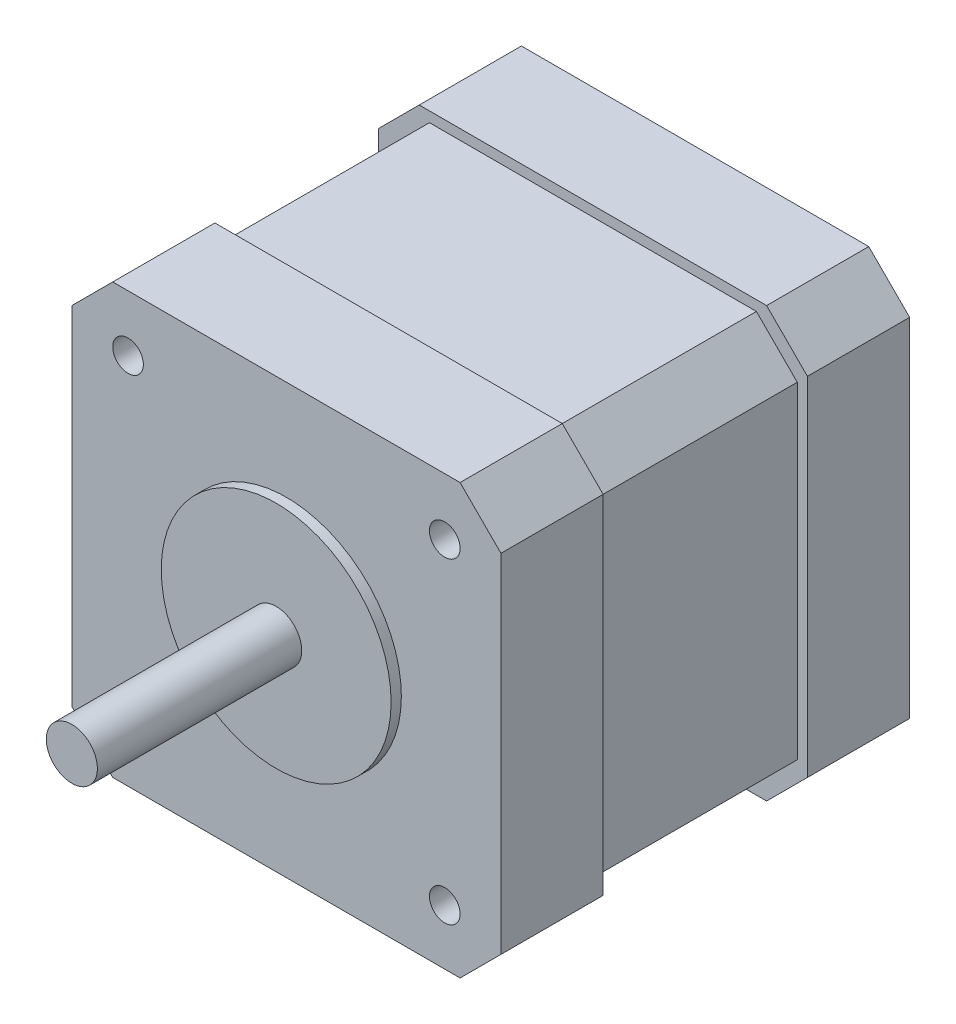
ISO-10303-21;
HEADER;
FILE_DESCRIPTION(('STEP AP214'),'2;1');
FILE_NAME('part.step','',(''),(''),'','','');
FILE_SCHEMA(('AUTOMOTIVE_DESIGN { 1 0 10303 214 1 1 1 1 }'));
ENDSEC;
DATA;
#1=APPLICATION_CONTEXT('core data for automotive mechanical design processes');
#2=APPLICATION_PROTOCOL_DEFINITION('international standard','automotive_design',2000,#1);
#3=PRODUCT_CONTEXT('',#1,'mechanical');
#4=PRODUCT('Part','Part','',(#3));
#5=PRODUCT_RELATED_PRODUCT_CATEGORY('part','',(#4));
#6=PRODUCT_DEFINITION_FORMATION('','',#4);
#7=PRODUCT_DEFINITION_CONTEXT('part definition',#1,'design');
#8=PRODUCT_DEFINITION('design','',#6,#7);
#9=PRODUCT_DEFINITION_SHAPE('','',#8);
#10=(LENGTH_UNIT() NAMED_UNIT(*) SI_UNIT(.MILLI.,.METRE.));
#11=(NAMED_UNIT(*) PLANE_ANGLE_UNIT() SI_UNIT($,.RADIAN.));
#12=(NAMED_UNIT(*) SI_UNIT($,.STERADIAN.) SOLID_ANGLE_UNIT());
#13=UNCERTAINTY_MEASURE_WITH_UNIT(LENGTH_MEASURE(1.E-05),#10,'distance_accuracy_value','');
#14=(GEOMETRIC_REPRESENTATION_CONTEXT(3) GLOBAL_UNCERTAINTY_ASSIGNED_CONTEXT((#13)) GLOBAL_UNIT_ASSIGNED_CONTEXT((#10,
#11,#12)) REPRESENTATION_CONTEXT('',''));
#15=CARTESIAN_POINT('',(0.,0.,0.));
#16=DIRECTION('',(0.,0.,1.));
#17=DIRECTION('',(1.,0.,0.));
#18=AXIS2_PLACEMENT_3D('',#15,#16,#17);
#19=CARTESIAN_POINT('',(0.,0.,10.));
#20=DIRECTION('',(0.,0.,1.));
#21=DIRECTION('',(1.,0.,0.));
#22=AXIS2_PLACEMENT_3D('',#19,#20,#21);
#23=PLANE('',#22);
#24=DIRECTION('',(0.,-1.,0.));
#25=VECTOR('',#24,1.);
#26=CARTESIAN_POINT('',(-21.,21.,10.));
#27=LINE('',#26,#25);
#28=CARTESIAN_POINT('',(-21.,17.,10.));
#29=VERTEX_POINT('',#28);
#30=CARTESIAN_POINT('',(-21.,-17.,10.));
#31=VERTEX_POINT('',#30);
#32=EDGE_CURVE('E263',#29,#31,#27,.T.);
#33=ORIENTED_EDGE('',*,*,#32,.T.);
#34=DIRECTION('',(-0.707106781186546,0.707106781186549,0.));
#35=VECTOR('',#34,1.);
#36=CARTESIAN_POINT('',(-19.,-19.,10.));
#37=LINE('',#36,#35);
#38=CARTESIAN_POINT('',(-17.,-21.,10.));
#39=VERTEX_POINT('',#38);
#40=EDGE_CURVE('E11',#31,#39,#37,.F.);
#41=ORIENTED_EDGE('',*,*,#40,.T.);
#42=DIRECTION('',(1.,0.,0.));
#43=VECTOR('',#42,1.);
#44=CARTESIAN_POINT('',(-21.,-21.,10.));
#45=LINE('',#44,#43);
#46=CARTESIAN_POINT('',(17.,-21.,10.));
#47=VERTEX_POINT('',#46);
#48=EDGE_CURVE('E266',#39,#47,#45,.T.);
#49=ORIENTED_EDGE('',*,*,#48,.T.);
#50=DIRECTION('',(-0.707106781186548,-0.707106781186547,0.));
#51=VECTOR('',#50,1.);
#52=CARTESIAN_POINT('',(19.,-19.,10.));
#53=LINE('',#52,#51);
#54=CARTESIAN_POINT('',(21.,-17.,10.));
#55=VERTEX_POINT('',#54);
#56=EDGE_CURVE('E42',#47,#55,#53,.F.);
#57=ORIENTED_EDGE('',*,*,#56,.T.);
#58=DIRECTION('',(0.,1.,0.));
#59=VECTOR('',#58,1.);
#60=CARTESIAN_POINT('',(21.,21.,10.));
#61=LINE('',#60,#59);
#62=CARTESIAN_POINT('',(21.,17.,10.));
#63=VERTEX_POINT('',#62);
#64=EDGE_CURVE('E258',#55,#63,#61,.T.);
#65=ORIENTED_EDGE('',*,*,#64,.T.);
#66=DIRECTION('',(0.707106781186547,-0.707106781186548,0.));
#67=VECTOR('',#66,1.);
#68=CARTESIAN_POINT('',(19.,19.,10.));
#69=LINE('',#68,#67);
#70=CARTESIAN_POINT('',(17.,21.,10.));
#71=VERTEX_POINT('',#70);
#72=EDGE_CURVE('E56',#63,#71,#69,.F.);
#73=ORIENTED_EDGE('',*,*,#72,.T.);
#74=DIRECTION('',(-1.,0.,0.));
#75=VECTOR('',#74,1.);
#76=CARTESIAN_POINT('',(-21.,21.,10.));
#77=LINE('',#76,#75);
#78=CARTESIAN_POINT('',(-17.,21.,10.));
#79=VERTEX_POINT('',#78);
#80=EDGE_CURVE('E260',#71,#79,#77,.T.);
#81=ORIENTED_EDGE('',*,*,#80,.T.);
#82=DIRECTION('',(0.707106781186548,0.707106781186547,0.));
#83=VECTOR('',#82,1.);
#84=CARTESIAN_POINT('',(-19.,19.,10.));
#85=LINE('',#84,#83);
#86=EDGE_CURVE('E206',#79,#29,#85,.F.);
#87=ORIENTED_EDGE('',*,*,#86,.T.);
#88=EDGE_LOOP('',(#33,#41,#49,#57,#65,#73,#81,#87));
#89=FACE_BOUND('',#88,.T.);
#90=DIRECTION('',(-1.,0.,0.));
#91=VECTOR('',#90,1.);
#92=CARTESIAN_POINT('',(-20.,20.,10.));
#93=LINE('',#92,#91);
#94=CARTESIAN_POINT('',(16.,20.,10.));
#95=VERTEX_POINT('',#94);
#96=CARTESIAN_POINT('',(-16.,20.,10.));
#97=VERTEX_POINT('',#96);
#98=EDGE_CURVE('E250',#95,#97,#93,.T.);
#99=ORIENTED_EDGE('',*,*,#98,.F.);
#100=DIRECTION('',(-0.707106781186546,0.707106781186549,0.));
#101=VECTOR('',#100,1.);
#102=CARTESIAN_POINT('',(16.,20.,10.));
#103=LINE('',#102,#101);
#104=CARTESIAN_POINT('',(20.,16.,10.));
#105=VERTEX_POINT('',#104);
#106=EDGE_CURVE('E355',#95,#105,#103,.F.);
#107=ORIENTED_EDGE('',*,*,#106,.T.);
#108=DIRECTION('',(0.,1.,0.));
#109=VECTOR('',#108,1.);
#110=CARTESIAN_POINT('',(20.,20.,10.));
#111=LINE('',#110,#109);
#112=CARTESIAN_POINT('',(20.,-16.,10.));
#113=VERTEX_POINT('',#112);
#114=EDGE_CURVE('E247',#113,#105,#111,.T.);
#115=ORIENTED_EDGE('',*,*,#114,.F.);
#116=DIRECTION('',(0.707106781186548,0.707106781186547,0.));
#117=VECTOR('',#116,1.);
#118=CARTESIAN_POINT('',(20.,-16.,10.));
#119=LINE('',#118,#117);
#120=CARTESIAN_POINT('',(16.,-20.,10.));
#121=VERTEX_POINT('',#120);
#122=EDGE_CURVE('E351',#113,#121,#119,.F.);
#123=ORIENTED_EDGE('',*,*,#122,.T.);
#124=DIRECTION('',(1.,0.,0.));
#125=VECTOR('',#124,1.);
#126=CARTESIAN_POINT('',(-20.,-20.,10.));
#127=LINE('',#126,#125);
#128=CARTESIAN_POINT('',(-16.,-20.,10.));
#129=VERTEX_POINT('',#128);
#130=EDGE_CURVE('E237',#129,#121,#127,.T.);
#131=ORIENTED_EDGE('',*,*,#130,.F.);
#132=DIRECTION('',(0.707106781186547,-0.707106781186548,0.));
#133=VECTOR('',#132,1.);
#134=CARTESIAN_POINT('',(-16.,-20.,10.));
#135=LINE('',#134,#133);
#136=CARTESIAN_POINT('',(-20.,-16.,10.));
#137=VERTEX_POINT('',#136);
#138=EDGE_CURVE('E347',#129,#137,#135,.F.);
#139=ORIENTED_EDGE('',*,*,#138,.T.);
#140=DIRECTION('',(0.,-1.,0.));
#141=VECTOR('',#140,1.);
#142=CARTESIAN_POINT('',(-20.,20.,10.));
#143=LINE('',#142,#141);
#144=CARTESIAN_POINT('',(-20.,16.,10.));
#145=VERTEX_POINT('',#144);
#146=EDGE_CURVE('E253',#145,#137,#143,.T.);
#147=ORIENTED_EDGE('',*,*,#146,.F.);
#148=DIRECTION('',(-0.707106781186548,-0.707106781186547,0.));
#149=VECTOR('',#148,1.);
#150=CARTESIAN_POINT('',(-20.,16.,10.));
#151=LINE('',#150,#149);
#152=EDGE_CURVE('E359',#145,#97,#151,.F.);
#153=ORIENTED_EDGE('',*,*,#152,.T.);
#154=EDGE_LOOP('',(#99,#107,#115,#123,#131,#139,#147,#153));
#155=FACE_BOUND('',#154,.T.);
#156=ADVANCED_FACE('F34',(#89,#155),#23,.T.);
#157=CARTESIAN_POINT('',(21.,21.,10.));
#158=DIRECTION('',(-1.,0.,0.));
#159=DIRECTION('',(0.,0.,1.));
#160=AXIS2_PLACEMENT_3D('',#157,#158,#159);
#161=PLANE('',#160);
#162=ORIENTED_EDGE('',*,*,#64,.F.);
#163=DIRECTION('',(0.,0.,-1.));
#164=VECTOR('',#163,1.);
#165=CARTESIAN_POINT('',(21.,-17.,10.));
#166=LINE('',#165,#164);
#167=CARTESIAN_POINT('',(21.,-17.,0.));
#168=VERTEX_POINT('',#167);
#169=EDGE_CURVE('E330',#55,#168,#166,.T.);
#170=ORIENTED_EDGE('',*,*,#169,.T.);
#171=DIRECTION('',(0.,1.,0.));
#172=VECTOR('',#171,1.);
#173=CARTESIAN_POINT('',(21.,21.,0.));
#174=LINE('',#173,#172);
#175=CARTESIAN_POINT('',(21.,17.,0.));
#176=VERTEX_POINT('',#175);
#177=EDGE_CURVE('E246',#168,#176,#174,.T.);
#178=ORIENTED_EDGE('',*,*,#177,.T.);
#179=DIRECTION('',(0.,0.,1.));
#180=VECTOR('',#179,1.);
#181=CARTESIAN_POINT('',(21.,17.,10.));
#182=LINE('',#181,#180);
#183=EDGE_CURVE('E328',#176,#63,#182,.T.);
#184=ORIENTED_EDGE('',*,*,#183,.T.);
#185=EDGE_LOOP('',(#162,#170,#178,#184));
#186=FACE_BOUND('',#185,.T.);
#187=ADVANCED_FACE('F377',(#186),#161,.F.);
#188=CARTESIAN_POINT('',(-21.,21.,10.));
#189=DIRECTION('',(0.,-1.,0.));
#190=DIRECTION('',(0.,0.,-1.));
#191=AXIS2_PLACEMENT_3D('',#188,#189,#190);
#192=PLANE('',#191);
#193=ORIENTED_EDGE('',*,*,#80,.F.);
#194=DIRECTION('',(0.,0.,-1.));
#195=VECTOR('',#194,1.);
#196=CARTESIAN_POINT('',(17.,21.,10.));
#197=LINE('',#196,#195);
#198=CARTESIAN_POINT('',(17.,21.,0.));
#199=VERTEX_POINT('',#198);
#200=EDGE_CURVE('E344',#71,#199,#197,.T.);
#201=ORIENTED_EDGE('',*,*,#200,.T.);
#202=DIRECTION('',(-1.,0.,0.));
#203=VECTOR('',#202,1.);
#204=CARTESIAN_POINT('',(-21.,21.,0.));
#205=LINE('',#204,#203);
#206=CARTESIAN_POINT('',(-17.,21.,0.));
#207=VERTEX_POINT('',#206);
#208=EDGE_CURVE('E271',#199,#207,#205,.T.);
#209=ORIENTED_EDGE('',*,*,#208,.T.);
#210=DIRECTION('',(0.,0.,1.));
#211=VECTOR('',#210,1.);
#212=CARTESIAN_POINT('',(-17.,21.,10.));
#213=LINE('',#212,#211);
#214=EDGE_CURVE('E49',#207,#79,#213,.T.);
#215=ORIENTED_EDGE('',*,*,#214,.T.);
#216=EDGE_LOOP('',(#193,#201,#209,#215));
#217=FACE_BOUND('',#216,.T.);
#218=ADVANCED_FACE('F399',(#217),#192,.F.);
#219=CARTESIAN_POINT('',(-21.,21.,10.));
#220=DIRECTION('',(1.,0.,0.));
#221=DIRECTION('',(0.,1.,0.));
#222=AXIS2_PLACEMENT_3D('',#219,#220,#221);
#223=PLANE('',#222);
#224=DIRECTION('',(0.,-1.,0.));
#225=VECTOR('',#224,1.);
#226=CARTESIAN_POINT('',(-21.,21.,0.));
#227=LINE('',#226,#225);
#228=CARTESIAN_POINT('',(-21.,17.,0.));
#229=VERTEX_POINT('',#228);
#230=CARTESIAN_POINT('',(-21.,-17.,0.));
#231=VERTEX_POINT('',#230);
#232=EDGE_CURVE('E273',#229,#231,#227,.T.);
#233=ORIENTED_EDGE('',*,*,#232,.T.);
#234=DIRECTION('',(0.,0.,1.));
#235=VECTOR('',#234,1.);
#236=CARTESIAN_POINT('',(-21.,-17.,10.));
#237=LINE('',#236,#235);
#238=EDGE_CURVE('E316',#231,#31,#237,.T.);
#239=ORIENTED_EDGE('',*,*,#238,.T.);
#240=ORIENTED_EDGE('',*,*,#32,.F.);
#241=DIRECTION('',(0.,0.,-1.));
#242=VECTOR('',#241,1.);
#243=CARTESIAN_POINT('',(-21.,17.,10.));
#244=LINE('',#243,#242);
#245=EDGE_CURVE('E313',#29,#229,#244,.T.);
#246=ORIENTED_EDGE('',*,*,#245,.T.);
#247=EDGE_LOOP('',(#233,#239,#240,#246));
#248=FACE_BOUND('',#247,.T.);
#249=ADVANCED_FACE('F393',(#248),#223,.F.);
#250=CARTESIAN_POINT('',(-21.,-21.,10.));
#251=DIRECTION('',(0.,1.,0.));
#252=DIRECTION('',(0.,0.,1.));
#253=AXIS2_PLACEMENT_3D('',#250,#251,#252);
#254=PLANE('',#253);
#255=ORIENTED_EDGE('',*,*,#48,.F.);
#256=DIRECTION('',(0.,0.,-1.));
#257=VECTOR('',#256,1.);
#258=CARTESIAN_POINT('',(-17.,-21.,10.));
#259=LINE('',#258,#257);
#260=CARTESIAN_POINT('',(-17.,-21.,0.));
#261=VERTEX_POINT('',#260);
#262=EDGE_CURVE('E302',#39,#261,#259,.T.);
#263=ORIENTED_EDGE('',*,*,#262,.T.);
#264=DIRECTION('',(1.,0.,0.));
#265=VECTOR('',#264,1.);
#266=CARTESIAN_POINT('',(-21.,-21.,0.));
#267=LINE('',#266,#265);
#268=CARTESIAN_POINT('',(17.,-21.,0.));
#269=VERTEX_POINT('',#268);
#270=EDGE_CURVE('E261',#261,#269,#267,.T.);
#271=ORIENTED_EDGE('',*,*,#270,.T.);
#272=DIRECTION('',(0.,0.,1.));
#273=VECTOR('',#272,1.);
#274=CARTESIAN_POINT('',(17.,-21.,10.));
#275=LINE('',#274,#273);
#276=EDGE_CURVE('E300',#269,#47,#275,.T.);
#277=ORIENTED_EDGE('',*,*,#276,.T.);
#278=EDGE_LOOP('',(#255,#263,#271,#277));
#279=FACE_BOUND('',#278,.T.);
#280=ADVANCED_FACE('F385',(#279),#254,.F.);
#281=CARTESIAN_POINT('',(0.,0.,0.));
#282=DIRECTION('',(0.,0.,1.));
#283=DIRECTION('',(1.,0.,0.));
#284=AXIS2_PLACEMENT_3D('',#281,#282,#283);
#285=PLANE('',#284);
#286=CARTESIAN_POINT('',(15.5,-15.5821340242442,0.));
#287=DIRECTION('',(0.,0.,1.));
#288=DIRECTION('',(1.,0.,0.));
#289=AXIS2_PLACEMENT_3D('',#286,#287,#288);
#290=CIRCLE('',#289,1.5);
#291=CARTESIAN_POINT('',(17.,-15.5821340242442,0.));
#292=VERTEX_POINT('',#291);
#293=EDGE_CURVE('E578',#292,#292,#290,.T.);
#294=ORIENTED_EDGE('',*,*,#293,.T.);
#295=EDGE_LOOP('',(#294));
#296=FACE_BOUND('',#295,.T.);
#297=CARTESIAN_POINT('',(15.5,15.4178659757558,0.));
#298=DIRECTION('',(0.,0.,1.));
#299=DIRECTION('',(1.,0.,0.));
#300=AXIS2_PLACEMENT_3D('',#297,#298,#299);
#301=CIRCLE('',#300,1.5);
#302=CARTESIAN_POINT('',(17.,15.4178659757558,0.));
#303=VERTEX_POINT('',#302);
#304=EDGE_CURVE('E586',#303,#303,#301,.T.);
#305=ORIENTED_EDGE('',*,*,#304,.T.);
#306=EDGE_LOOP('',(#305));
#307=FACE_BOUND('',#306,.T.);
#308=CARTESIAN_POINT('',(-15.5,15.5,0.));
#309=DIRECTION('',(0.,0.,1.));
#310=DIRECTION('',(1.,0.,0.));
#311=AXIS2_PLACEMENT_3D('',#308,#309,#310);
#312=CIRCLE('',#311,1.5);
#313=CARTESIAN_POINT('',(-14.,15.5,0.));
#314=VERTEX_POINT('',#313);
#315=EDGE_CURVE('E592',#314,#314,#312,.T.);
#316=ORIENTED_EDGE('',*,*,#315,.T.);
#317=EDGE_LOOP('',(#316));
#318=FACE_BOUND('',#317,.T.);
#319=CARTESIAN_POINT('',(-15.5,-15.5,0.));
#320=DIRECTION('',(0.,0.,1.));
#321=DIRECTION('',(1.,0.,0.));
#322=AXIS2_PLACEMENT_3D('',#319,#320,#321);
#323=CIRCLE('',#322,1.5);
#324=CARTESIAN_POINT('',(-14.,-15.5,0.));
#325=VERTEX_POINT('',#324);
#326=EDGE_CURVE('E598',#325,#325,#323,.T.);
#327=ORIENTED_EDGE('',*,*,#326,.T.);
#328=EDGE_LOOP('',(#327));
#329=FACE_BOUND('',#328,.T.);
#330=ORIENTED_EDGE('',*,*,#270,.F.);
#331=DIRECTION('',(0.707106781186546,-0.707106781186549,0.));
#332=VECTOR('',#331,1.);
#333=CARTESIAN_POINT('',(-17.,-21.,0.));
#334=LINE('',#333,#332);
#335=EDGE_CURVE('E311',#261,#231,#334,.F.);
#336=ORIENTED_EDGE('',*,*,#335,.T.);
#337=ORIENTED_EDGE('',*,*,#232,.F.);
#338=DIRECTION('',(-0.707106781186548,-0.707106781186547,0.));
#339=VECTOR('',#338,1.);
#340=CARTESIAN_POINT('',(-21.,17.,0.));
#341=LINE('',#340,#339);
#342=EDGE_CURVE('E305',#229,#207,#341,.F.);
#343=ORIENTED_EDGE('',*,*,#342,.T.);
#344=ORIENTED_EDGE('',*,*,#208,.F.);
#345=DIRECTION('',(-0.707106781186547,0.707106781186548,0.));
#346=VECTOR('',#345,1.);
#347=CARTESIAN_POINT('',(17.,21.,0.));
#348=LINE('',#347,#346);
#349=EDGE_CURVE('E307',#199,#176,#348,.F.);
#350=ORIENTED_EDGE('',*,*,#349,.T.);
#351=ORIENTED_EDGE('',*,*,#177,.F.);
#352=DIRECTION('',(0.707106781186548,0.707106781186547,0.));
#353=VECTOR('',#352,1.);
#354=CARTESIAN_POINT('',(21.,-17.,0.));
#355=LINE('',#354,#353);
#356=EDGE_CURVE('E309',#168,#269,#355,.F.);
#357=ORIENTED_EDGE('',*,*,#356,.T.);
#358=EDGE_LOOP('',(#330,#336,#337,#343,#344,#350,#351,#357));
#359=FACE_BOUND('',#358,.T.);
#360=ADVANCED_FACE('F383',(#296,#307,#318,#329,#359),#285,.F.);
#361=CARTESIAN_POINT('',(20.,20.,30.));
#362=DIRECTION('',(-1.,0.,0.));
#363=DIRECTION('',(0.,-1.,0.));
#364=AXIS2_PLACEMENT_3D('',#361,#362,#363);
#365=PLANE('',#364);
#366=DIRECTION('',(0.,1.,0.));
#367=VECTOR('',#366,1.);
#368=CARTESIAN_POINT('',(20.,20.,30.));
#369=LINE('',#368,#367);
#370=CARTESIAN_POINT('',(20.,-16.,30.));
#371=VERTEX_POINT('',#370);
#372=CARTESIAN_POINT('',(20.,16.,30.));
#373=VERTEX_POINT('',#372);
#374=EDGE_CURVE('E233',#371,#373,#369,.T.);
#375=ORIENTED_EDGE('',*,*,#374,.F.);
#376=DIRECTION('',(0.,0.,-1.));
#377=VECTOR('',#376,1.);
#378=CARTESIAN_POINT('',(20.,-16.,30.));
#379=LINE('',#378,#377);
#380=EDGE_CURVE('E325',#371,#113,#379,.T.);
#381=ORIENTED_EDGE('',*,*,#380,.T.);
#382=ORIENTED_EDGE('',*,*,#114,.T.);
#383=DIRECTION('',(0.,0.,1.));
#384=VECTOR('',#383,1.);
#385=CARTESIAN_POINT('',(20.,16.,30.));
#386=LINE('',#385,#384);
#387=EDGE_CURVE('E323',#105,#373,#386,.T.);
#388=ORIENTED_EDGE('',*,*,#387,.T.);
#389=EDGE_LOOP('',(#375,#381,#382,#388));
#390=FACE_BOUND('',#389,.T.);
#391=ADVANCED_FACE('F425',(#390),#365,.F.);
#392=CARTESIAN_POINT('',(-20.,20.,30.));
#393=DIRECTION('',(0.,-1.,0.));
#394=DIRECTION('',(0.,0.,-1.));
#395=AXIS2_PLACEMENT_3D('',#392,#393,#394);
#396=PLANE('',#395);
#397=DIRECTION('',(-1.,0.,0.));
#398=VECTOR('',#397,1.);
#399=CARTESIAN_POINT('',(-20.,20.,30.));
#400=LINE('',#399,#398);
#401=CARTESIAN_POINT('',(16.,20.,30.));
#402=VERTEX_POINT('',#401);
#403=CARTESIAN_POINT('',(-16.,20.,30.));
#404=VERTEX_POINT('',#403);
#405=EDGE_CURVE('E236',#402,#404,#400,.T.);
#406=ORIENTED_EDGE('',*,*,#405,.F.);
#407=DIRECTION('',(0.,0.,-1.));
#408=VECTOR('',#407,1.);
#409=CARTESIAN_POINT('',(16.,20.,30.));
#410=LINE('',#409,#408);
#411=EDGE_CURVE('E340',#402,#95,#410,.T.);
#412=ORIENTED_EDGE('',*,*,#411,.T.);
#413=ORIENTED_EDGE('',*,*,#98,.T.);
#414=DIRECTION('',(0.,0.,1.));
#415=VECTOR('',#414,1.);
#416=CARTESIAN_POINT('',(-16.,20.,30.));
#417=LINE('',#416,#415);
#418=EDGE_CURVE('E338',#97,#404,#417,.T.);
#419=ORIENTED_EDGE('',*,*,#418,.T.);
#420=EDGE_LOOP('',(#406,#412,#413,#419));
#421=FACE_BOUND('',#420,.T.);
#422=ADVANCED_FACE('F507',(#421),#396,.F.);
#423=CARTESIAN_POINT('',(-20.,20.,30.));
#424=DIRECTION('',(1.,0.,0.));
#425=DIRECTION('',(0.,1.,0.));
#426=AXIS2_PLACEMENT_3D('',#423,#424,#425);
#427=PLANE('',#426);
#428=ORIENTED_EDGE('',*,*,#146,.T.);
#429=DIRECTION('',(0.,0.,1.));
#430=VECTOR('',#429,1.);
#431=CARTESIAN_POINT('',(-20.,-16.,30.));
#432=LINE('',#431,#430);
#433=CARTESIAN_POINT('',(-20.,-16.,30.));
#434=VERTEX_POINT('',#433);
#435=EDGE_CURVE('E298',#137,#434,#432,.T.);
#436=ORIENTED_EDGE('',*,*,#435,.T.);
#437=DIRECTION('',(0.,-1.,0.));
#438=VECTOR('',#437,1.);
#439=CARTESIAN_POINT('',(-20.,20.,30.));
#440=LINE('',#439,#438);
#441=CARTESIAN_POINT('',(-20.,16.,30.));
#442=VERTEX_POINT('',#441);
#443=EDGE_CURVE('E240',#442,#434,#440,.T.);
#444=ORIENTED_EDGE('',*,*,#443,.F.);
#445=DIRECTION('',(0.,0.,-1.));
#446=VECTOR('',#445,1.);
#447=CARTESIAN_POINT('',(-20.,16.,30.));
#448=LINE('',#447,#446);
#449=EDGE_CURVE('E295',#442,#145,#448,.T.);
#450=ORIENTED_EDGE('',*,*,#449,.T.);
#451=EDGE_LOOP('',(#428,#436,#444,#450));
#452=FACE_BOUND('',#451,.T.);
#453=ADVANCED_FACE('F504',(#452),#427,.F.);
#454=CARTESIAN_POINT('',(-20.,-20.,30.));
#455=DIRECTION('',(0.,1.,0.));
#456=DIRECTION('',(0.,0.,1.));
#457=AXIS2_PLACEMENT_3D('',#454,#455,#456);
#458=PLANE('',#457);
#459=DIRECTION('',(1.,0.,0.));
#460=VECTOR('',#459,1.);
#461=CARTESIAN_POINT('',(-20.,-20.,30.));
#462=LINE('',#461,#460);
#463=CARTESIAN_POINT('',(-16.,-20.,30.));
#464=VERTEX_POINT('',#463);
#465=CARTESIAN_POINT('',(16.,-20.,30.));
#466=VERTEX_POINT('',#465);
#467=EDGE_CURVE('E243',#464,#466,#462,.T.);
#468=ORIENTED_EDGE('',*,*,#467,.F.);
#469=DIRECTION('',(0.,0.,-1.));
#470=VECTOR('',#469,1.);
#471=CARTESIAN_POINT('',(-16.,-20.,30.));
#472=LINE('',#471,#470);
#473=EDGE_CURVE('E292',#464,#129,#472,.T.);
#474=ORIENTED_EDGE('',*,*,#473,.T.);
#475=ORIENTED_EDGE('',*,*,#130,.T.);
#476=DIRECTION('',(0.,0.,1.));
#477=VECTOR('',#476,1.);
#478=CARTESIAN_POINT('',(16.,-20.,30.));
#479=LINE('',#478,#477);
#480=EDGE_CURVE('E290',#121,#466,#479,.T.);
#481=ORIENTED_EDGE('',*,*,#480,.T.);
#482=EDGE_LOOP('',(#468,#474,#475,#481));
#483=FACE_BOUND('',#482,.T.);
#484=ADVANCED_FACE('F501',(#483),#458,.F.);
#485=CARTESIAN_POINT('',(0.,0.,30.));
#486=DIRECTION('',(0.,0.,1.));
#487=DIRECTION('',(1.,0.,0.));
#488=AXIS2_PLACEMENT_3D('',#485,#486,#487);
#489=PLANE('',#488);
#490=DIRECTION('',(1.,0.,0.));
#491=VECTOR('',#490,1.);
#492=CARTESIAN_POINT('',(-21.,-21.,30.));
#493=LINE('',#492,#491);
#494=CARTESIAN_POINT('',(-17.,-21.,30.));
#495=VERTEX_POINT('',#494);
#496=CARTESIAN_POINT('',(17.,-21.,30.));
#497=VERTEX_POINT('',#496);
#498=EDGE_CURVE('E213',#495,#497,#493,.T.);
#499=ORIENTED_EDGE('',*,*,#498,.F.);
#500=DIRECTION('',(0.707106781186546,-0.707106781186549,0.));
#501=VECTOR('',#500,1.);
#502=CARTESIAN_POINT('',(-17.,-21.,30.));
#503=LINE('',#502,#501);
#504=CARTESIAN_POINT('',(-21.,-17.,30.));
#505=VERTEX_POINT('',#504);
#506=EDGE_CURVE('E196',#495,#505,#503,.F.);
#507=ORIENTED_EDGE('',*,*,#506,.T.);
#508=DIRECTION('',(0.,-1.,0.));
#509=VECTOR('',#508,1.);
#510=CARTESIAN_POINT('',(-21.,21.,30.));
#511=LINE('',#510,#509);
#512=CARTESIAN_POINT('',(-21.,17.,30.));
#513=VERTEX_POINT('',#512);
#514=EDGE_CURVE('E224',#513,#505,#511,.T.);
#515=ORIENTED_EDGE('',*,*,#514,.F.);
#516=DIRECTION('',(-0.707106781186549,-0.707106781186546,0.));
#517=VECTOR('',#516,1.);
#518=CARTESIAN_POINT('',(-21.,17.,30.));
#519=LINE('',#518,#517);
#520=CARTESIAN_POINT('',(-17.,21.,30.));
#521=VERTEX_POINT('',#520);
#522=EDGE_CURVE('E363',#513,#521,#519,.F.);
#523=ORIENTED_EDGE('',*,*,#522,.T.);
#524=DIRECTION('',(-1.,0.,0.));
#525=VECTOR('',#524,1.);
#526=CARTESIAN_POINT('',(-21.,21.,30.));
#527=LINE('',#526,#525);
#528=CARTESIAN_POINT('',(17.,21.,30.));
#529=VERTEX_POINT('',#528);
#530=EDGE_CURVE('E229',#529,#521,#527,.T.);
#531=ORIENTED_EDGE('',*,*,#530,.F.);
#532=DIRECTION('',(-0.707106781186547,0.707106781186548,0.));
#533=VECTOR('',#532,1.);
#534=CARTESIAN_POINT('',(17.,21.,30.));
#535=LINE('',#534,#533);
#536=CARTESIAN_POINT('',(21.,17.,30.));
#537=VERTEX_POINT('',#536);
#538=EDGE_CURVE('E365',#529,#537,#535,.F.);
#539=ORIENTED_EDGE('',*,*,#538,.T.);
#540=DIRECTION('',(0.,1.,0.));
#541=VECTOR('',#540,1.);
#542=CARTESIAN_POINT('',(21.,21.,30.));
#543=LINE('',#542,#541);
#544=CARTESIAN_POINT('',(21.,-17.,30.));
#545=VERTEX_POINT('',#544);
#546=EDGE_CURVE('E480',#545,#537,#543,.T.);
#547=ORIENTED_EDGE('',*,*,#546,.F.);
#548=DIRECTION('',(0.707106781186548,0.707106781186547,0.));
#549=VECTOR('',#548,1.);
#550=CARTESIAN_POINT('',(21.,-17.,30.));
#551=LINE('',#550,#549);
#552=EDGE_CURVE('E207',#545,#497,#551,.F.);
#553=ORIENTED_EDGE('',*,*,#552,.T.);
#554=EDGE_LOOP('',(#499,#507,#515,#523,#531,#539,#547,#553));
#555=FACE_BOUND('',#554,.T.);
#556=ORIENTED_EDGE('',*,*,#443,.T.);
#557=DIRECTION('',(-0.707106781186547,0.707106781186548,0.));
#558=VECTOR('',#557,1.);
#559=CARTESIAN_POINT('',(-18.,-18.,30.));
#560=LINE('',#559,#558);
#561=EDGE_CURVE('E349',#434,#464,#560,.F.);
#562=ORIENTED_EDGE('',*,*,#561,.T.);
#563=ORIENTED_EDGE('',*,*,#467,.T.);
#564=DIRECTION('',(-0.707106781186548,-0.707106781186547,0.));
#565=VECTOR('',#564,1.);
#566=CARTESIAN_POINT('',(18.,-18.,30.));
#567=LINE('',#566,#565);
#568=EDGE_CURVE('E353',#466,#371,#567,.F.);
#569=ORIENTED_EDGE('',*,*,#568,.T.);
#570=ORIENTED_EDGE('',*,*,#374,.T.);
#571=DIRECTION('',(0.707106781186546,-0.707106781186549,0.));
#572=VECTOR('',#571,1.);
#573=CARTESIAN_POINT('',(18.,18.,30.));
#574=LINE('',#573,#572);
#575=EDGE_CURVE('E357',#373,#402,#574,.F.);
#576=ORIENTED_EDGE('',*,*,#575,.T.);
#577=ORIENTED_EDGE('',*,*,#405,.T.);
#578=DIRECTION('',(0.707106781186548,0.707106781186547,0.));
#579=VECTOR('',#578,1.);
#580=CARTESIAN_POINT('',(-18.,18.,30.));
#581=LINE('',#580,#579);
#582=EDGE_CURVE('E361',#404,#442,#581,.F.);
#583=ORIENTED_EDGE('',*,*,#582,.T.);
#584=EDGE_LOOP('',(#556,#562,#563,#569,#570,#576,#577,#583));
#585=FACE_BOUND('',#584,.T.);
#586=ADVANCED_FACE('F220',(#555,#585),#489,.F.);
#587=CARTESIAN_POINT('',(21.,21.,40.));
#588=DIRECTION('',(-1.,0.,0.));
#589=DIRECTION('',(0.,0.,1.));
#590=AXIS2_PLACEMENT_3D('',#587,#588,#589);
#591=PLANE('',#590);
#592=DIRECTION('',(0.,1.,0.));
#593=VECTOR('',#592,1.);
#594=CARTESIAN_POINT('',(21.,21.,40.));
#595=LINE('',#594,#593);
#596=CARTESIAN_POINT('',(21.,-17.,40.));
#597=VERTEX_POINT('',#596);
#598=CARTESIAN_POINT('',(21.,17.,40.));
#599=VERTEX_POINT('',#598);
#600=EDGE_CURVE('E223',#597,#599,#595,.T.);
#601=ORIENTED_EDGE('',*,*,#600,.F.);
#602=DIRECTION('',(0.,0.,-1.));
#603=VECTOR('',#602,1.);
#604=CARTESIAN_POINT('',(21.,-17.,40.));
#605=LINE('',#604,#603);
#606=EDGE_CURVE('E320',#597,#545,#605,.T.);
#607=ORIENTED_EDGE('',*,*,#606,.T.);
#608=ORIENTED_EDGE('',*,*,#546,.T.);
#609=DIRECTION('',(0.,0.,1.));
#610=VECTOR('',#609,1.);
#611=CARTESIAN_POINT('',(21.,17.,40.));
#612=LINE('',#611,#610);
#613=EDGE_CURVE('E318',#537,#599,#612,.T.);
#614=ORIENTED_EDGE('',*,*,#613,.T.);
#615=EDGE_LOOP('',(#601,#607,#608,#614));
#616=FACE_BOUND('',#615,.T.);
#617=ADVANCED_FACE('F494',(#616),#591,.F.);
#618=CARTESIAN_POINT('',(-21.,21.,40.));
#619=DIRECTION('',(0.,-1.,0.));
#620=DIRECTION('',(0.,0.,-1.));
#621=AXIS2_PLACEMENT_3D('',#618,#619,#620);
#622=PLANE('',#621);
#623=DIRECTION('',(-1.,0.,0.));
#624=VECTOR('',#623,1.);
#625=CARTESIAN_POINT('',(-21.,21.,40.));
#626=LINE('',#625,#624);
#627=CARTESIAN_POINT('',(17.,21.,40.));
#628=VERTEX_POINT('',#627);
#629=CARTESIAN_POINT('',(-17.,21.,40.));
#630=VERTEX_POINT('',#629);
#631=EDGE_CURVE('E227',#628,#630,#626,.T.);
#632=ORIENTED_EDGE('',*,*,#631,.F.);
#633=DIRECTION('',(0.,0.,-1.));
#634=VECTOR('',#633,1.);
#635=CARTESIAN_POINT('',(17.,21.,40.));
#636=LINE('',#635,#634);
#637=EDGE_CURVE('E335',#628,#529,#636,.T.);
#638=ORIENTED_EDGE('',*,*,#637,.T.);
#639=ORIENTED_EDGE('',*,*,#530,.T.);
#640=DIRECTION('',(0.,0.,1.));
#641=VECTOR('',#640,1.);
#642=CARTESIAN_POINT('',(-17.,21.,40.));
#643=LINE('',#642,#641);
#644=EDGE_CURVE('E333',#521,#630,#643,.T.);
#645=ORIENTED_EDGE('',*,*,#644,.T.);
#646=EDGE_LOOP('',(#632,#638,#639,#645));
#647=FACE_BOUND('',#646,.T.);
#648=ADVANCED_FACE('F470',(#647),#622,.F.);
#649=CARTESIAN_POINT('',(-21.,21.,40.));
#650=DIRECTION('',(1.,0.,0.));
#651=DIRECTION('',(0.,1.,0.));
#652=AXIS2_PLACEMENT_3D('',#649,#650,#651);
#653=PLANE('',#652);
#654=ORIENTED_EDGE('',*,*,#514,.T.);
#655=DIRECTION('',(0.,0.,1.));
#656=VECTOR('',#655,1.);
#657=CARTESIAN_POINT('',(-21.,-17.,40.));
#658=LINE('',#657,#656);
#659=CARTESIAN_POINT('',(-21.,-17.,40.));
#660=VERTEX_POINT('',#659);
#661=EDGE_CURVE('E201',#505,#660,#658,.T.);
#662=ORIENTED_EDGE('',*,*,#661,.T.);
#663=DIRECTION('',(0.,-1.,0.));
#664=VECTOR('',#663,1.);
#665=CARTESIAN_POINT('',(-21.,21.,40.));
#666=LINE('',#665,#664);
#667=CARTESIAN_POINT('',(-21.,17.,40.));
#668=VERTEX_POINT('',#667);
#669=EDGE_CURVE('E474',#668,#660,#666,.T.);
#670=ORIENTED_EDGE('',*,*,#669,.F.);
#671=DIRECTION('',(0.,0.,-1.));
#672=VECTOR('',#671,1.);
#673=CARTESIAN_POINT('',(-21.,17.,40.));
#674=LINE('',#673,#672);
#675=EDGE_CURVE('E217',#668,#513,#674,.T.);
#676=ORIENTED_EDGE('',*,*,#675,.T.);
#677=EDGE_LOOP('',(#654,#662,#670,#676));
#678=FACE_BOUND('',#677,.T.);
#679=ADVANCED_FACE('F486',(#678),#653,.F.);
#680=CARTESIAN_POINT('',(-21.,-21.,40.));
#681=DIRECTION('',(0.,1.,0.));
#682=DIRECTION('',(0.,0.,1.));
#683=AXIS2_PLACEMENT_3D('',#680,#681,#682);
#684=PLANE('',#683);
#685=DIRECTION('',(1.,0.,0.));
#686=VECTOR('',#685,1.);
#687=CARTESIAN_POINT('',(-21.,-21.,40.));
#688=LINE('',#687,#686);
#689=CARTESIAN_POINT('',(-17.,-21.,40.));
#690=VERTEX_POINT('',#689);
#691=CARTESIAN_POINT('',(17.,-21.,40.));
#692=VERTEX_POINT('',#691);
#693=EDGE_CURVE('E216',#690,#692,#688,.T.);
#694=ORIENTED_EDGE('',*,*,#693,.F.);
#695=DIRECTION('',(0.,0.,-1.));
#696=VECTOR('',#695,1.);
#697=CARTESIAN_POINT('',(-17.,-21.,40.));
#698=LINE('',#697,#696);
#699=EDGE_CURVE('E200',#690,#495,#698,.T.);
#700=ORIENTED_EDGE('',*,*,#699,.T.);
#701=ORIENTED_EDGE('',*,*,#498,.T.);
#702=DIRECTION('',(0.,0.,1.));
#703=VECTOR('',#702,1.);
#704=CARTESIAN_POINT('',(17.,-21.,40.));
#705=LINE('',#704,#703);
#706=EDGE_CURVE('E218',#497,#692,#705,.T.);
#707=ORIENTED_EDGE('',*,*,#706,.T.);
#708=EDGE_LOOP('',(#694,#700,#701,#707));
#709=FACE_BOUND('',#708,.T.);
#710=ADVANCED_FACE('F212',(#709),#684,.F.);
#711=CARTESIAN_POINT('',(0.,0.,40.));
#712=DIRECTION('',(0.,0.,1.));
#713=DIRECTION('',(1.,0.,0.));
#714=AXIS2_PLACEMENT_3D('',#711,#712,#713);
#715=PLANE('',#714);
#716=CARTESIAN_POINT('',(15.5,-15.5821340242442,40.));
#717=DIRECTION('',(0.,0.,1.));
#718=DIRECTION('',(1.,0.,0.));
#719=AXIS2_PLACEMENT_3D('',#716,#717,#718);
#720=CIRCLE('',#719,1.5);
#721=CARTESIAN_POINT('',(17.,-15.5821340242442,40.));
#722=VERTEX_POINT('',#721);
#723=EDGE_CURVE('E581',#722,#722,#720,.T.);
#724=ORIENTED_EDGE('',*,*,#723,.F.);
#725=EDGE_LOOP('',(#724));
#726=FACE_BOUND('',#725,.T.);
#727=CARTESIAN_POINT('',(15.5,15.4178659757558,40.));
#728=DIRECTION('',(0.,0.,1.));
#729=DIRECTION('',(1.,0.,0.));
#730=AXIS2_PLACEMENT_3D('',#727,#728,#729);
#731=CIRCLE('',#730,1.5);
#732=CARTESIAN_POINT('',(17.,15.4178659757558,40.));
#733=VERTEX_POINT('',#732);
#734=EDGE_CURVE('E583',#733,#733,#731,.T.);
#735=ORIENTED_EDGE('',*,*,#734,.F.);
#736=EDGE_LOOP('',(#735));
#737=FACE_BOUND('',#736,.T.);
#738=CARTESIAN_POINT('',(-15.5,15.5,40.));
#739=DIRECTION('',(0.,0.,1.));
#740=DIRECTION('',(1.,0.,0.));
#741=AXIS2_PLACEMENT_3D('',#738,#739,#740);
#742=CIRCLE('',#741,1.5);
#743=CARTESIAN_POINT('',(-14.,15.5,40.));
#744=VERTEX_POINT('',#743);
#745=EDGE_CURVE('E589',#744,#744,#742,.T.);
#746=ORIENTED_EDGE('',*,*,#745,.F.);
#747=EDGE_LOOP('',(#746));
#748=FACE_BOUND('',#747,.T.);
#749=CARTESIAN_POINT('',(-15.5,-15.5,40.));
#750=DIRECTION('',(0.,0.,1.));
#751=DIRECTION('',(1.,0.,0.));
#752=AXIS2_PLACEMENT_3D('',#749,#750,#751);
#753=CIRCLE('',#752,1.5);
#754=CARTESIAN_POINT('',(-14.,-15.5,40.));
#755=VERTEX_POINT('',#754);
#756=EDGE_CURVE('E595',#755,#755,#753,.T.);
#757=ORIENTED_EDGE('',*,*,#756,.F.);
#758=EDGE_LOOP('',(#757));
#759=FACE_BOUND('',#758,.T.);
#760=CARTESIAN_POINT('',(0.,0.,40.));
#761=DIRECTION('',(0.,0.,1.));
#762=DIRECTION('',(1.,0.,0.));
#763=AXIS2_PLACEMENT_3D('',#760,#761,#762);
#764=CIRCLE('',#763,11.25);
#765=CARTESIAN_POINT('',(11.25,0.,40.));
#766=VERTEX_POINT('',#765);
#767=EDGE_CURVE('E607',#766,#766,#764,.T.);
#768=ORIENTED_EDGE('',*,*,#767,.F.);
#769=EDGE_LOOP('',(#768));
#770=FACE_BOUND('',#769,.T.);
#771=ORIENTED_EDGE('',*,*,#669,.T.);
#772=DIRECTION('',(-0.707106781186546,0.707106781186549,0.));
#773=VECTOR('',#772,1.);
#774=CARTESIAN_POINT('',(-19.,-19.,40.));
#775=LINE('',#774,#773);
#776=EDGE_CURVE('E288',#660,#690,#775,.F.);
#777=ORIENTED_EDGE('',*,*,#776,.T.);
#778=ORIENTED_EDGE('',*,*,#693,.T.);
#779=DIRECTION('',(-0.707106781186548,-0.707106781186547,0.));
#780=VECTOR('',#779,1.);
#781=CARTESIAN_POINT('',(19.,-19.,40.));
#782=LINE('',#781,#780);
#783=EDGE_CURVE('E286',#692,#597,#782,.F.);
#784=ORIENTED_EDGE('',*,*,#783,.T.);
#785=ORIENTED_EDGE('',*,*,#600,.T.);
#786=DIRECTION('',(0.707106781186547,-0.707106781186548,0.));
#787=VECTOR('',#786,1.);
#788=CARTESIAN_POINT('',(19.,19.,40.));
#789=LINE('',#788,#787);
#790=EDGE_CURVE('E284',#599,#628,#789,.F.);
#791=ORIENTED_EDGE('',*,*,#790,.T.);
#792=ORIENTED_EDGE('',*,*,#631,.T.);
#793=DIRECTION('',(0.707106781186549,0.707106781186546,0.));
#794=VECTOR('',#793,1.);
#795=CARTESIAN_POINT('',(-19.,19.,40.));
#796=LINE('',#795,#794);
#797=EDGE_CURVE('E282',#630,#668,#796,.F.);
#798=ORIENTED_EDGE('',*,*,#797,.T.);
#799=EDGE_LOOP('',(#771,#777,#778,#784,#785,#791,#792,#798));
#800=FACE_BOUND('',#799,.T.);
#801=ADVANCED_FACE('F466',(#726,#737,#748,#759,#770,#800),#715,.T.);
#802=CARTESIAN_POINT('',(0.,0.,41.));
#803=DIRECTION('',(0.,0.,-1.));
#804=DIRECTION('',(-1.,0.,0.));
#805=AXIS2_PLACEMENT_3D('',#802,#803,#804);
#806=CYLINDRICAL_SURFACE('',#805,11.25);
#807=CARTESIAN_POINT('',(0.,0.,41.));
#808=DIRECTION('',(0.,0.,1.));
#809=DIRECTION('',(1.,0.,0.));
#810=AXIS2_PLACEMENT_3D('',#807,#808,#809);
#811=CIRCLE('',#810,11.25);
#812=CARTESIAN_POINT('',(11.25,0.,41.));
#813=VERTEX_POINT('',#812);
#814=EDGE_CURVE('E482',#813,#813,#811,.T.);
#815=ORIENTED_EDGE('',*,*,#814,.F.);
#816=EDGE_LOOP('',(#815));
#817=FACE_BOUND('',#816,.T.);
#818=ORIENTED_EDGE('',*,*,#767,.T.);
#819=EDGE_LOOP('',(#818));
#820=FACE_BOUND('',#819,.T.);
#821=ADVANCED_FACE('F542',(#817,#820),#806,.T.);
#822=CARTESIAN_POINT('',(0.,0.,41.));
#823=DIRECTION('',(0.,0.,1.));
#824=DIRECTION('',(1.,0.,0.));
#825=AXIS2_PLACEMENT_3D('',#822,#823,#824);
#826=PLANE('',#825);
#827=CARTESIAN_POINT('',(0.,0.,41.));
#828=DIRECTION('',(0.,0.,1.));
#829=DIRECTION('',(1.,0.,0.));
#830=AXIS2_PLACEMENT_3D('',#827,#828,#829);
#831=CIRCLE('',#830,2.5);
#832=CARTESIAN_POINT('',(2.5,0.,41.));
#833=VERTEX_POINT('',#832);
#834=EDGE_CURVE('E601',#833,#833,#831,.T.);
#835=ORIENTED_EDGE('',*,*,#834,.F.);
#836=EDGE_LOOP('',(#835));
#837=FACE_BOUND('',#836,.T.);
#838=ORIENTED_EDGE('',*,*,#814,.T.);
#839=EDGE_LOOP('',(#838));
#840=FACE_BOUND('',#839,.T.);
#841=ADVANCED_FACE('F439',(#837,#840),#826,.T.);
#842=CARTESIAN_POINT('',(-17.,-21.,40.));
#843=DIRECTION('',(0.707106781186549,0.707106781186546,0.));
#844=DIRECTION('',(0.,0.,-1.));
#845=AXIS2_PLACEMENT_3D('',#842,#843,#844);
#846=PLANE('',#845);
#847=ORIENTED_EDGE('',*,*,#776,.F.);
#848=ORIENTED_EDGE('',*,*,#661,.F.);
#849=ORIENTED_EDGE('',*,*,#506,.F.);
#850=ORIENTED_EDGE('',*,*,#699,.F.);
#851=EDGE_LOOP('',(#847,#848,#849,#850));
#852=FACE_BOUND('',#851,.T.);
#853=ADVANCED_FACE('F199',(#852),#846,.F.);
#854=CARTESIAN_POINT('',(-16.,-20.,30.));
#855=DIRECTION('',(0.707106781186548,0.707106781186547,0.));
#856=DIRECTION('',(0.,0.,-1.));
#857=AXIS2_PLACEMENT_3D('',#854,#855,#856);
#858=PLANE('',#857);
#859=ORIENTED_EDGE('',*,*,#561,.F.);
#860=ORIENTED_EDGE('',*,*,#435,.F.);
#861=ORIENTED_EDGE('',*,*,#138,.F.);
#862=ORIENTED_EDGE('',*,*,#473,.F.);
#863=EDGE_LOOP('',(#859,#860,#861,#862));
#864=FACE_BOUND('',#863,.T.);
#865=ADVANCED_FACE('F438',(#864),#858,.F.);
#866=CARTESIAN_POINT('',(-17.,-21.,10.));
#867=DIRECTION('',(0.707106781186549,0.707106781186546,0.));
#868=DIRECTION('',(0.,0.,-1.));
#869=AXIS2_PLACEMENT_3D('',#866,#867,#868);
#870=PLANE('',#869);
#871=ORIENTED_EDGE('',*,*,#40,.F.);
#872=ORIENTED_EDGE('',*,*,#238,.F.);
#873=ORIENTED_EDGE('',*,*,#335,.F.);
#874=ORIENTED_EDGE('',*,*,#262,.F.);
#875=EDGE_LOOP('',(#871,#872,#873,#874));
#876=FACE_BOUND('',#875,.T.);
#877=ADVANCED_FACE('F389',(#876),#870,.F.);
#878=CARTESIAN_POINT('',(21.,-17.,40.));
#879=DIRECTION('',(-0.707106781186547,0.707106781186548,0.));
#880=DIRECTION('',(0.,0.,-1.));
#881=AXIS2_PLACEMENT_3D('',#878,#879,#880);
#882=PLANE('',#881);
#883=ORIENTED_EDGE('',*,*,#783,.F.);
#884=ORIENTED_EDGE('',*,*,#706,.F.);
#885=ORIENTED_EDGE('',*,*,#552,.F.);
#886=ORIENTED_EDGE('',*,*,#606,.F.);
#887=EDGE_LOOP('',(#883,#884,#885,#886));
#888=FACE_BOUND('',#887,.T.);
#889=ADVANCED_FACE('F445',(#888),#882,.F.);
#890=CARTESIAN_POINT('',(20.,-16.,30.));
#891=DIRECTION('',(-0.707106781186547,0.707106781186548,0.));
#892=DIRECTION('',(0.,0.,-1.));
#893=AXIS2_PLACEMENT_3D('',#890,#891,#892);
#894=PLANE('',#893);
#895=ORIENTED_EDGE('',*,*,#568,.F.);
#896=ORIENTED_EDGE('',*,*,#480,.F.);
#897=ORIENTED_EDGE('',*,*,#122,.F.);
#898=ORIENTED_EDGE('',*,*,#380,.F.);
#899=EDGE_LOOP('',(#895,#896,#897,#898));
#900=FACE_BOUND('',#899,.T.);
#901=ADVANCED_FACE('F448',(#900),#894,.F.);
#902=CARTESIAN_POINT('',(21.,-17.,10.));
#903=DIRECTION('',(-0.707106781186547,0.707106781186548,0.));
#904=DIRECTION('',(0.,0.,-1.));
#905=AXIS2_PLACEMENT_3D('',#902,#903,#904);
#906=PLANE('',#905);
#907=ORIENTED_EDGE('',*,*,#56,.F.);
#908=ORIENTED_EDGE('',*,*,#276,.F.);
#909=ORIENTED_EDGE('',*,*,#356,.F.);
#910=ORIENTED_EDGE('',*,*,#169,.F.);
#911=EDGE_LOOP('',(#907,#908,#909,#910));
#912=FACE_BOUND('',#911,.T.);
#913=ADVANCED_FACE('F380',(#912),#906,.F.);
#914=CARTESIAN_POINT('',(17.,21.,40.));
#915=DIRECTION('',(-0.707106781186548,-0.707106781186547,0.));
#916=DIRECTION('',(0.,0.,-1.));
#917=AXIS2_PLACEMENT_3D('',#914,#915,#916);
#918=PLANE('',#917);
#919=ORIENTED_EDGE('',*,*,#790,.F.);
#920=ORIENTED_EDGE('',*,*,#613,.F.);
#921=ORIENTED_EDGE('',*,*,#538,.F.);
#922=ORIENTED_EDGE('',*,*,#637,.F.);
#923=EDGE_LOOP('',(#919,#920,#921,#922));
#924=FACE_BOUND('',#923,.T.);
#925=ADVANCED_FACE('F414',(#924),#918,.F.);
#926=CARTESIAN_POINT('',(16.,20.,30.));
#927=DIRECTION('',(-0.707106781186549,-0.707106781186546,0.));
#928=DIRECTION('',(0.,0.,-1.));
#929=AXIS2_PLACEMENT_3D('',#926,#927,#928);
#930=PLANE('',#929);
#931=ORIENTED_EDGE('',*,*,#575,.F.);
#932=ORIENTED_EDGE('',*,*,#387,.F.);
#933=ORIENTED_EDGE('',*,*,#106,.F.);
#934=ORIENTED_EDGE('',*,*,#411,.F.);
#935=EDGE_LOOP('',(#931,#932,#933,#934));
#936=FACE_BOUND('',#935,.T.);
#937=ADVANCED_FACE('F405',(#936),#930,.F.);
#938=CARTESIAN_POINT('',(17.,21.,10.));
#939=DIRECTION('',(-0.707106781186548,-0.707106781186547,0.));
#940=DIRECTION('',(0.,0.,-1.));
#941=AXIS2_PLACEMENT_3D('',#938,#939,#940);
#942=PLANE('',#941);
#943=ORIENTED_EDGE('',*,*,#72,.F.);
#944=ORIENTED_EDGE('',*,*,#183,.F.);
#945=ORIENTED_EDGE('',*,*,#349,.F.);
#946=ORIENTED_EDGE('',*,*,#200,.F.);
#947=EDGE_LOOP('',(#943,#944,#945,#946));
#948=FACE_BOUND('',#947,.T.);
#949=ADVANCED_FACE('F402',(#948),#942,.F.);
#950=CARTESIAN_POINT('',(-21.,17.,40.));
#951=DIRECTION('',(0.707106781186546,-0.707106781186549,0.));
#952=DIRECTION('',(0.,0.,-1.));
#953=AXIS2_PLACEMENT_3D('',#950,#951,#952);
#954=PLANE('',#953);
#955=ORIENTED_EDGE('',*,*,#797,.F.);
#956=ORIENTED_EDGE('',*,*,#644,.F.);
#957=ORIENTED_EDGE('',*,*,#522,.F.);
#958=ORIENTED_EDGE('',*,*,#675,.F.);
#959=EDGE_LOOP('',(#955,#956,#957,#958));
#960=FACE_BOUND('',#959,.T.);
#961=ADVANCED_FACE('F404',(#960),#954,.F.);
#962=CARTESIAN_POINT('',(-20.,16.,30.));
#963=DIRECTION('',(0.707106781186547,-0.707106781186548,0.));
#964=DIRECTION('',(0.,0.,-1.));
#965=AXIS2_PLACEMENT_3D('',#962,#963,#964);
#966=PLANE('',#965);
#967=ORIENTED_EDGE('',*,*,#582,.F.);
#968=ORIENTED_EDGE('',*,*,#418,.F.);
#969=ORIENTED_EDGE('',*,*,#152,.F.);
#970=ORIENTED_EDGE('',*,*,#449,.F.);
#971=EDGE_LOOP('',(#967,#968,#969,#970));
#972=FACE_BOUND('',#971,.T.);
#973=ADVANCED_FACE('F411',(#972),#966,.F.);
#974=CARTESIAN_POINT('',(-21.,17.,10.));
#975=DIRECTION('',(0.707106781186547,-0.707106781186548,0.));
#976=DIRECTION('',(0.,0.,-1.));
#977=AXIS2_PLACEMENT_3D('',#974,#975,#976);
#978=PLANE('',#977);
#979=ORIENTED_EDGE('',*,*,#86,.F.);
#980=ORIENTED_EDGE('',*,*,#214,.F.);
#981=ORIENTED_EDGE('',*,*,#342,.F.);
#982=ORIENTED_EDGE('',*,*,#245,.F.);
#983=EDGE_LOOP('',(#979,#980,#981,#982));
#984=FACE_BOUND('',#983,.T.);
#985=ADVANCED_FACE('F36',(#984),#978,.F.);
#986=CARTESIAN_POINT('',(0.,0.,61.));
#987=DIRECTION('',(0.,0.,-1.));
#988=DIRECTION('',(-1.,0.,0.));
#989=AXIS2_PLACEMENT_3D('',#986,#987,#988);
#990=CYLINDRICAL_SURFACE('',#989,2.5);
#991=CARTESIAN_POINT('',(0.,0.,61.));
#992=DIRECTION('',(0.,0.,1.));
#993=DIRECTION('',(1.,0.,0.));
#994=AXIS2_PLACEMENT_3D('',#991,#992,#993);
#995=CIRCLE('',#994,2.5);
#996=CARTESIAN_POINT('',(2.5,0.,61.));
#997=VERTEX_POINT('',#996);
#998=EDGE_CURVE('E604',#997,#997,#995,.T.);
#999=ORIENTED_EDGE('',*,*,#998,.F.);
#1000=EDGE_LOOP('',(#999));
#1001=FACE_BOUND('',#1000,.T.);
#1002=ORIENTED_EDGE('',*,*,#834,.T.);
#1003=EDGE_LOOP('',(#1002));
#1004=FACE_BOUND('',#1003,.T.);
#1005=ADVANCED_FACE('F550',(#1001,#1004),#990,.T.);
#1006=CARTESIAN_POINT('',(0.,0.,61.));
#1007=DIRECTION('',(0.,0.,1.));
#1008=DIRECTION('',(1.,0.,0.));
#1009=AXIS2_PLACEMENT_3D('',#1006,#1007,#1008);
#1010=PLANE('',#1009);
#1011=ORIENTED_EDGE('',*,*,#998,.T.);
#1012=EDGE_LOOP('',(#1011));
#1013=FACE_BOUND('',#1012,.T.);
#1014=ADVANCED_FACE('F553',(#1013),#1010,.T.);
#1015=CARTESIAN_POINT('',(-15.5,-15.5,0.));
#1016=DIRECTION('',(0.,0.,1.));
#1017=DIRECTION('',(1.,0.,0.));
#1018=AXIS2_PLACEMENT_3D('',#1015,#1016,#1017);
#1019=CYLINDRICAL_SURFACE('',#1018,1.5);
#1020=ORIENTED_EDGE('',*,*,#326,.F.);
#1021=EDGE_LOOP('',(#1020));
#1022=FACE_BOUND('',#1021,.T.);
#1023=ORIENTED_EDGE('',*,*,#756,.T.);
#1024=EDGE_LOOP('',(#1023));
#1025=FACE_BOUND('',#1024,.T.);
#1026=ADVANCED_FACE('F557',(#1022,#1025),#1019,.F.);
#1027=CARTESIAN_POINT('',(-15.5,15.5,0.));
#1028=DIRECTION('',(0.,0.,1.));
#1029=DIRECTION('',(1.,0.,0.));
#1030=AXIS2_PLACEMENT_3D('',#1027,#1028,#1029);
#1031=CYLINDRICAL_SURFACE('',#1030,1.5);
#1032=ORIENTED_EDGE('',*,*,#315,.F.);
#1033=EDGE_LOOP('',(#1032));
#1034=FACE_BOUND('',#1033,.T.);
#1035=ORIENTED_EDGE('',*,*,#745,.T.);
#1036=EDGE_LOOP('',(#1035));
#1037=FACE_BOUND('',#1036,.T.);
#1038=ADVANCED_FACE('F561',(#1034,#1037),#1031,.F.);
#1039=CARTESIAN_POINT('',(15.5,15.4178659757558,0.));
#1040=DIRECTION('',(0.,0.,1.));
#1041=DIRECTION('',(1.,0.,0.));
#1042=AXIS2_PLACEMENT_3D('',#1039,#1040,#1041);
#1043=CYLINDRICAL_SURFACE('',#1042,1.5);
#1044=ORIENTED_EDGE('',*,*,#304,.F.);
#1045=EDGE_LOOP('',(#1044));
#1046=FACE_BOUND('',#1045,.T.);
#1047=ORIENTED_EDGE('',*,*,#734,.T.);
#1048=EDGE_LOOP('',(#1047));
#1049=FACE_BOUND('',#1048,.T.);
#1050=ADVANCED_FACE('F565',(#1046,#1049),#1043,.F.);
#1051=CARTESIAN_POINT('',(15.5,-15.5821340242442,0.));
#1052=DIRECTION('',(0.,0.,1.));
#1053=DIRECTION('',(1.,0.,0.));
#1054=AXIS2_PLACEMENT_3D('',#1051,#1052,#1053);
#1055=CYLINDRICAL_SURFACE('',#1054,1.5);
#1056=ORIENTED_EDGE('',*,*,#293,.F.);
#1057=EDGE_LOOP('',(#1056));
#1058=FACE_BOUND('',#1057,.T.);
#1059=ORIENTED_EDGE('',*,*,#723,.T.);
#1060=EDGE_LOOP('',(#1059));
#1061=FACE_BOUND('',#1060,.T.);
#1062=ADVANCED_FACE('F569',(#1058,#1061),#1055,.F.);
#1063=CLOSED_SHELL('',(#156,#187,#218,#249,#280,#360,#391,#422,#453,#484,#586,#617,#648,#679,
#710,#801,#821,#841,#853,#865,#877,#889,#901,#913,#925,#937,#949,#961,#973,#985,#1005,#1014,
#1026,#1038,#1050,#1062));
#1064=MANIFOLD_SOLID_BREP('B2',#1063);
#1065=ADVANCED_BREP_SHAPE_REPRESENTATION('',(#18,#1064),#14);
#1066=SHAPE_DEFINITION_REPRESENTATION(#9,#1065);
ENDSEC;
END-ISO-10303-21;
